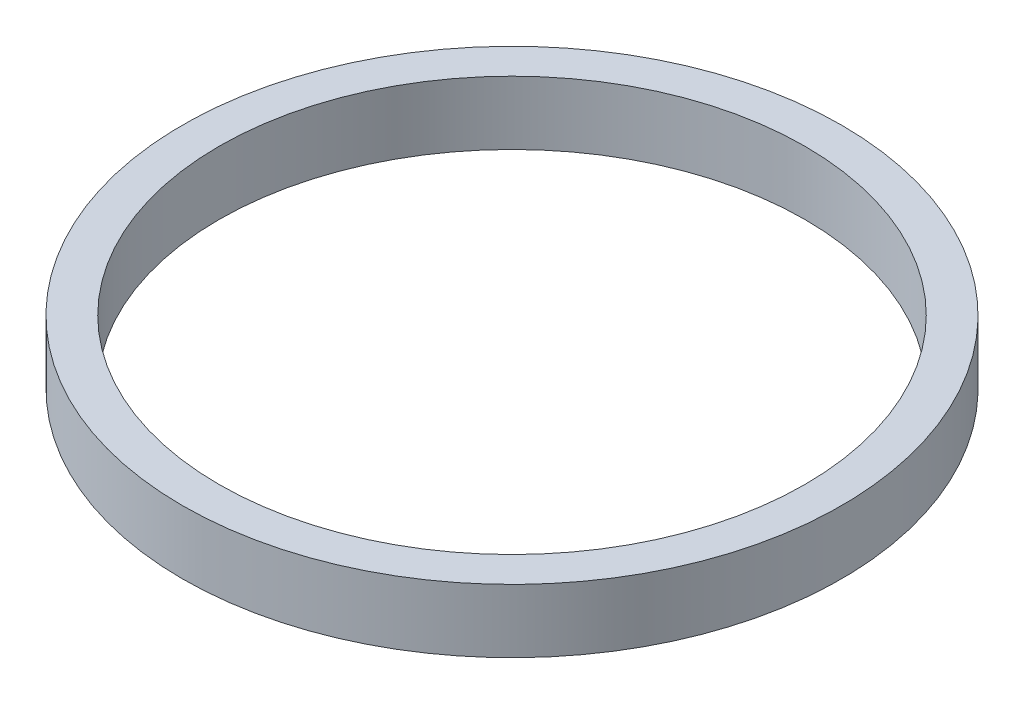
ISO-10303-21;
HEADER;
FILE_DESCRIPTION(('STEP AP214'),'2;1');
FILE_NAME('part.step','',(''),(''),'','','');
FILE_SCHEMA(('AUTOMOTIVE_DESIGN { 1 0 10303 214 1 1 1 1 }'));
ENDSEC;
DATA;
#1=APPLICATION_CONTEXT('core data for automotive mechanical design processes');
#2=APPLICATION_PROTOCOL_DEFINITION('international standard','automotive_design',2000,#1);
#3=PRODUCT_CONTEXT('',#1,'mechanical');
#4=PRODUCT('Part','Part','',(#3));
#5=PRODUCT_RELATED_PRODUCT_CATEGORY('part','',(#4));
#6=PRODUCT_DEFINITION_FORMATION('','',#4);
#7=PRODUCT_DEFINITION_CONTEXT('part definition',#1,'design');
#8=PRODUCT_DEFINITION('design','',#6,#7);
#9=PRODUCT_DEFINITION_SHAPE('','',#8);
#10=(LENGTH_UNIT() NAMED_UNIT(*) SI_UNIT(.MILLI.,.METRE.));
#11=(NAMED_UNIT(*) PLANE_ANGLE_UNIT() SI_UNIT($,.RADIAN.));
#12=(NAMED_UNIT(*) SI_UNIT($,.STERADIAN.) SOLID_ANGLE_UNIT());
#13=UNCERTAINTY_MEASURE_WITH_UNIT(LENGTH_MEASURE(1.E-05),#10,'distance_accuracy_value','');
#14=(GEOMETRIC_REPRESENTATION_CONTEXT(3) GLOBAL_UNCERTAINTY_ASSIGNED_CONTEXT((#13)) GLOBAL_UNIT_ASSIGNED_CONTEXT((#10,
#11,#12)) REPRESENTATION_CONTEXT('',''));
#15=CARTESIAN_POINT('',(0.,0.,0.));
#16=DIRECTION('',(0.,0.,1.));
#17=DIRECTION('',(1.,0.,0.));
#18=AXIS2_PLACEMENT_3D('',#15,#16,#17);
#19=CARTESIAN_POINT('',(0.,0.65,0.));
#20=DIRECTION('',(0.,-1.,0.));
#21=DIRECTION('',(0.,0.,-1.));
#22=AXIS2_PLACEMENT_3D('',#19,#20,#21);
#23=CYLINDRICAL_SURFACE('',#22,6.75);
#24=CARTESIAN_POINT('',(0.,0.65,0.));
#25=DIRECTION('',(0.,1.,0.));
#26=DIRECTION('',(0.,0.,1.));
#27=AXIS2_PLACEMENT_3D('',#24,#25,#26);
#28=CIRCLE('',#27,6.75);
#29=CARTESIAN_POINT('',(0.,0.65,6.75));
#30=VERTEX_POINT('',#29);
#31=EDGE_CURVE('E10',#30,#30,#28,.T.);
#32=ORIENTED_EDGE('',*,*,#31,.F.);
#33=EDGE_LOOP('',(#32));
#34=FACE_BOUND('',#33,.T.);
#35=CARTESIAN_POINT('',(0.,-0.65,0.));
#36=DIRECTION('',(0.,1.,0.));
#37=DIRECTION('',(0.,0.,1.));
#38=AXIS2_PLACEMENT_3D('',#35,#36,#37);
#39=CIRCLE('',#38,6.75);
#40=CARTESIAN_POINT('',(0.,-0.65,6.75));
#41=VERTEX_POINT('',#40);
#42=EDGE_CURVE('E36',#41,#41,#39,.T.);
#43=ORIENTED_EDGE('',*,*,#42,.T.);
#44=EDGE_LOOP('',(#43));
#45=FACE_BOUND('',#44,.T.);
#46=ADVANCED_FACE('F33',(#34,#45),#23,.T.);
#47=CARTESIAN_POINT('',(0.,0.65,0.));
#48=DIRECTION('',(0.,1.,0.));
#49=DIRECTION('',(0.,0.,1.));
#50=AXIS2_PLACEMENT_3D('',#47,#48,#49);
#51=PLANE('',#50);
#52=CARTESIAN_POINT('',(0.,0.65,0.));
#53=DIRECTION('',(0.,1.,0.));
#54=DIRECTION('',(0.,0.,1.));
#55=AXIS2_PLACEMENT_3D('',#52,#53,#54);
#56=CIRCLE('',#55,6.);
#57=CARTESIAN_POINT('',(0.,0.65,6.));
#58=VERTEX_POINT('',#57);
#59=EDGE_CURVE('E47',#58,#58,#56,.T.);
#60=ORIENTED_EDGE('',*,*,#59,.F.);
#61=EDGE_LOOP('',(#60));
#62=FACE_BOUND('',#61,.T.);
#63=ORIENTED_EDGE('',*,*,#31,.T.);
#64=EDGE_LOOP('',(#63));
#65=FACE_BOUND('',#64,.T.);
#66=ADVANCED_FACE('F53',(#62,#65),#51,.T.);
#67=CARTESIAN_POINT('',(0.,-0.65,0.));
#68=DIRECTION('',(0.,1.,0.));
#69=DIRECTION('',(0.,0.,1.));
#70=AXIS2_PLACEMENT_3D('',#67,#68,#69);
#71=PLANE('',#70);
#72=CARTESIAN_POINT('',(0.,-0.65,0.));
#73=DIRECTION('',(0.,1.,0.));
#74=DIRECTION('',(0.,0.,1.));
#75=AXIS2_PLACEMENT_3D('',#72,#73,#74);
#76=CIRCLE('',#75,6.);
#77=CARTESIAN_POINT('',(0.,-0.65,6.));
#78=VERTEX_POINT('',#77);
#79=EDGE_CURVE('E43',#78,#78,#76,.T.);
#80=ORIENTED_EDGE('',*,*,#79,.T.);
#81=EDGE_LOOP('',(#80));
#82=FACE_BOUND('',#81,.T.);
#83=ORIENTED_EDGE('',*,*,#42,.F.);
#84=EDGE_LOOP('',(#83));
#85=FACE_BOUND('',#84,.T.);
#86=ADVANCED_FACE('F55',(#82,#85),#71,.F.);
#87=CARTESIAN_POINT('',(0.,-0.65,0.));
#88=DIRECTION('',(0.,1.,0.));
#89=DIRECTION('',(0.,0.,1.));
#90=AXIS2_PLACEMENT_3D('',#87,#88,#89);
#91=CYLINDRICAL_SURFACE('',#90,6.);
#92=ORIENTED_EDGE('',*,*,#79,.F.);
#93=EDGE_LOOP('',(#92));
#94=FACE_BOUND('',#93,.T.);
#95=ORIENTED_EDGE('',*,*,#59,.T.);
#96=EDGE_LOOP('',(#95));
#97=FACE_BOUND('',#96,.T.);
#98=ADVANCED_FACE('F51',(#94,#97),#91,.F.);
#99=CLOSED_SHELL('',(#46,#66,#86,#98));
#100=MANIFOLD_SOLID_BREP('B2',#99);
#101=ADVANCED_BREP_SHAPE_REPRESENTATION('',(#18,#100),#14);
#102=SHAPE_DEFINITION_REPRESENTATION(#9,#101);
ENDSEC;
END-ISO-10303-21;
